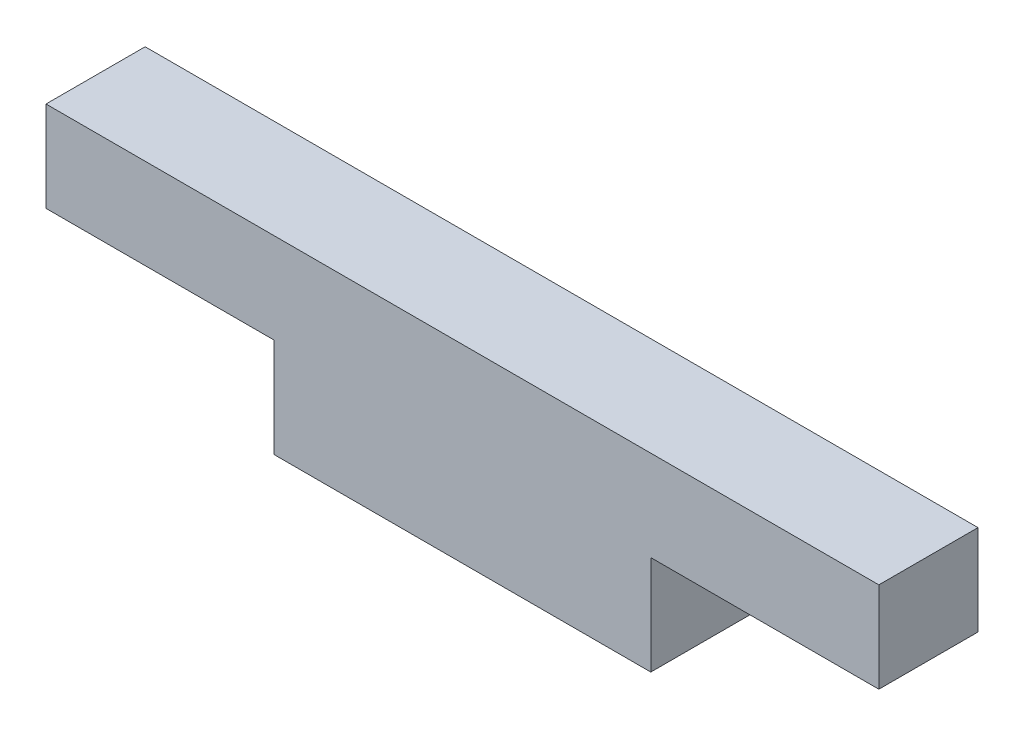
ISO-10303-21;
HEADER;
FILE_DESCRIPTION(('STEP AP214'),'2;1');
FILE_NAME('part.step','',(''),(''),'','','');
FILE_SCHEMA(('AUTOMOTIVE_DESIGN { 1 0 10303 214 1 1 1 1 }'));
ENDSEC;
DATA;
#1=APPLICATION_CONTEXT('core data for automotive mechanical design processes');
#2=APPLICATION_PROTOCOL_DEFINITION('international standard','automotive_design',2000,#1);
#3=PRODUCT_CONTEXT('',#1,'mechanical');
#4=PRODUCT('Part','Part','',(#3));
#5=PRODUCT_RELATED_PRODUCT_CATEGORY('part','',(#4));
#6=PRODUCT_DEFINITION_FORMATION('','',#4);
#7=PRODUCT_DEFINITION_CONTEXT('part definition',#1,'design');
#8=PRODUCT_DEFINITION('design','',#6,#7);
#9=PRODUCT_DEFINITION_SHAPE('','',#8);
#10=(LENGTH_UNIT() NAMED_UNIT(*) SI_UNIT(.MILLI.,.METRE.));
#11=(NAMED_UNIT(*) PLANE_ANGLE_UNIT() SI_UNIT($,.RADIAN.));
#12=(NAMED_UNIT(*) SI_UNIT($,.STERADIAN.) SOLID_ANGLE_UNIT());
#13=UNCERTAINTY_MEASURE_WITH_UNIT(LENGTH_MEASURE(1.E-05),#10,'distance_accuracy_value','');
#14=(GEOMETRIC_REPRESENTATION_CONTEXT(3) GLOBAL_UNCERTAINTY_ASSIGNED_CONTEXT((#13)) GLOBAL_UNIT_ASSIGNED_CONTEXT((#10,
#11,#12)) REPRESENTATION_CONTEXT('',''));
#15=CARTESIAN_POINT('',(0.,0.,0.));
#16=DIRECTION('',(0.,0.,1.));
#17=DIRECTION('',(1.,0.,0.));
#18=AXIS2_PLACEMENT_3D('',#15,#16,#17);
#19=CARTESIAN_POINT('',(0.,0.,0.));
#20=DIRECTION('',(0.,0.,1.));
#21=DIRECTION('',(1.,0.,0.));
#22=AXIS2_PLACEMENT_3D('',#19,#20,#21);
#23=PLANE('',#22);
#24=DIRECTION('',(1.,0.,0.));
#25=VECTOR('',#24,1.);
#26=CARTESIAN_POINT('',(21.,9.56,0.));
#27=LINE('',#26,#25);
#28=CARTESIAN_POINT('',(-21.,9.55999999999999,0.));
#29=VERTEX_POINT('',#28);
#30=CARTESIAN_POINT('',(21.,9.56,0.));
#31=VERTEX_POINT('',#30);
#32=EDGE_CURVE('E124',#29,#31,#27,.T.);
#33=ORIENTED_EDGE('',*,*,#32,.T.);
#34=DIRECTION('',(0.,-1.,0.));
#35=VECTOR('',#34,1.);
#36=CARTESIAN_POINT('',(21.,5.,0.));
#37=LINE('',#36,#35);
#38=CARTESIAN_POINT('',(21.,5.,0.));
#39=VERTEX_POINT('',#38);
#40=EDGE_CURVE('E119',#31,#39,#37,.T.);
#41=ORIENTED_EDGE('',*,*,#40,.T.);
#42=DIRECTION('',(-1.,0.,0.));
#43=VECTOR('',#42,1.);
#44=CARTESIAN_POINT('',(21.,5.,0.));
#45=LINE('',#44,#43);
#46=CARTESIAN_POINT('',(9.5,4.99999999999999,0.));
#47=VERTEX_POINT('',#46);
#48=EDGE_CURVE('E114',#39,#47,#45,.T.);
#49=ORIENTED_EDGE('',*,*,#48,.T.);
#50=DIRECTION('',(0.,-1.,0.));
#51=VECTOR('',#50,1.);
#52=CARTESIAN_POINT('',(9.5,4.99999999999999,0.));
#53=LINE('',#52,#51);
#54=CARTESIAN_POINT('',(9.5,0.,0.));
#55=VERTEX_POINT('',#54);
#56=EDGE_CURVE('E109',#47,#55,#53,.T.);
#57=ORIENTED_EDGE('',*,*,#56,.T.);
#58=DIRECTION('',(-1.,0.,0.));
#59=VECTOR('',#58,1.);
#60=CARTESIAN_POINT('',(9.5,0.,0.));
#61=LINE('',#60,#59);
#62=CARTESIAN_POINT('',(-9.5,0.,0.));
#63=VERTEX_POINT('',#62);
#64=EDGE_CURVE('E105',#55,#63,#61,.T.);
#65=ORIENTED_EDGE('',*,*,#64,.T.);
#66=DIRECTION('',(0.,1.,0.));
#67=VECTOR('',#66,1.);
#68=CARTESIAN_POINT('',(-9.5,4.99999999999999,0.));
#69=LINE('',#68,#67);
#70=CARTESIAN_POINT('',(-9.5,4.99999999999999,0.));
#71=VERTEX_POINT('',#70);
#72=EDGE_CURVE('E92',#63,#71,#69,.T.);
#73=ORIENTED_EDGE('',*,*,#72,.T.);
#74=DIRECTION('',(-1.,0.,0.));
#75=VECTOR('',#74,1.);
#76=CARTESIAN_POINT('',(-21.,4.99999999999999,0.));
#77=LINE('',#76,#75);
#78=CARTESIAN_POINT('',(-21.,4.99999999999999,0.));
#79=VERTEX_POINT('',#78);
#80=EDGE_CURVE('E78',#71,#79,#77,.T.);
#81=ORIENTED_EDGE('',*,*,#80,.T.);
#82=DIRECTION('',(0.,1.,0.));
#83=VECTOR('',#82,1.);
#84=CARTESIAN_POINT('',(-21.,4.99999999999999,0.));
#85=LINE('',#84,#83);
#86=EDGE_CURVE('E19',#79,#29,#85,.T.);
#87=ORIENTED_EDGE('',*,*,#86,.T.);
#88=EDGE_LOOP('',(#33,#41,#49,#57,#65,#73,#81,#87));
#89=FACE_BOUND('',#88,.T.);
#90=ADVANCED_FACE('F16',(#89),#23,.F.);
#91=CARTESIAN_POINT('',(-21.,4.99999999999999,5.));
#92=DIRECTION('',(1.,0.,0.));
#93=DIRECTION('',(0.,1.,0.));
#94=AXIS2_PLACEMENT_3D('',#91,#92,#93);
#95=PLANE('',#94);
#96=DIRECTION('',(0.,0.,1.));
#97=VECTOR('',#96,1.);
#98=CARTESIAN_POINT('',(-21.,4.99999999999999,5.));
#99=LINE('',#98,#97);
#100=CARTESIAN_POINT('',(-21.,4.99999999999999,5.));
#101=VERTEX_POINT('',#100);
#102=EDGE_CURVE('E84',#79,#101,#99,.T.);
#103=ORIENTED_EDGE('',*,*,#102,.T.);
#104=DIRECTION('',(0.,1.,0.));
#105=VECTOR('',#104,1.);
#106=CARTESIAN_POINT('',(-21.,0.,5.));
#107=LINE('',#106,#105);
#108=CARTESIAN_POINT('',(-21.,9.55999999999999,5.));
#109=VERTEX_POINT('',#108);
#110=EDGE_CURVE('E126',#109,#101,#107,.F.);
#111=ORIENTED_EDGE('',*,*,#110,.F.);
#112=DIRECTION('',(0.,0.,1.));
#113=VECTOR('',#112,1.);
#114=CARTESIAN_POINT('',(-21.,9.55999999999999,5.));
#115=LINE('',#114,#113);
#116=EDGE_CURVE('E87',#109,#29,#115,.F.);
#117=ORIENTED_EDGE('',*,*,#116,.T.);
#118=ORIENTED_EDGE('',*,*,#86,.F.);
#119=EDGE_LOOP('',(#103,#111,#117,#118));
#120=FACE_BOUND('',#119,.T.);
#121=ADVANCED_FACE('F83',(#120),#95,.F.);
#122=CARTESIAN_POINT('',(-21.,4.99999999999999,5.));
#123=DIRECTION('',(0.,1.,0.));
#124=DIRECTION('',(-1.,0.,0.));
#125=AXIS2_PLACEMENT_3D('',#122,#123,#124);
#126=PLANE('',#125);
#127=DIRECTION('',(0.,0.,-1.));
#128=VECTOR('',#127,1.);
#129=CARTESIAN_POINT('',(-9.5,4.99999999999999,5.));
#130=LINE('',#129,#128);
#131=CARTESIAN_POINT('',(-9.5,4.99999999999999,5.));
#132=VERTEX_POINT('',#131);
#133=EDGE_CURVE('E94',#71,#132,#130,.F.);
#134=ORIENTED_EDGE('',*,*,#133,.T.);
#135=DIRECTION('',(1.,0.,0.));
#136=VECTOR('',#135,1.);
#137=CARTESIAN_POINT('',(0.,4.99999999999999,5.));
#138=LINE('',#137,#136);
#139=EDGE_CURVE('E98',#101,#132,#138,.T.);
#140=ORIENTED_EDGE('',*,*,#139,.F.);
#141=ORIENTED_EDGE('',*,*,#102,.F.);
#142=ORIENTED_EDGE('',*,*,#80,.F.);
#143=EDGE_LOOP('',(#134,#140,#141,#142));
#144=FACE_BOUND('',#143,.T.);
#145=ADVANCED_FACE('F96',(#144),#126,.F.);
#146=CARTESIAN_POINT('',(-9.5,4.99999999999999,5.));
#147=DIRECTION('',(1.,0.,0.));
#148=DIRECTION('',(0.,0.,-1.));
#149=AXIS2_PLACEMENT_3D('',#146,#147,#148);
#150=PLANE('',#149);
#151=DIRECTION('',(0.,0.,1.));
#152=VECTOR('',#151,1.);
#153=CARTESIAN_POINT('',(-9.5,0.,5.));
#154=LINE('',#153,#152);
#155=CARTESIAN_POINT('',(-9.5,0.,5.));
#156=VERTEX_POINT('',#155);
#157=EDGE_CURVE('E103',#63,#156,#154,.T.);
#158=ORIENTED_EDGE('',*,*,#157,.T.);
#159=DIRECTION('',(0.,1.,0.));
#160=VECTOR('',#159,1.);
#161=CARTESIAN_POINT('',(-9.5,0.,5.));
#162=LINE('',#161,#160);
#163=EDGE_CURVE('E129',#132,#156,#162,.F.);
#164=ORIENTED_EDGE('',*,*,#163,.F.);
#165=ORIENTED_EDGE('',*,*,#133,.F.);
#166=ORIENTED_EDGE('',*,*,#72,.F.);
#167=EDGE_LOOP('',(#158,#164,#165,#166));
#168=FACE_BOUND('',#167,.T.);
#169=ADVANCED_FACE('F171',(#168),#150,.F.);
#170=CARTESIAN_POINT('',(9.5,0.,5.));
#171=DIRECTION('',(0.,1.,0.));
#172=DIRECTION('',(-1.,0.,0.));
#173=AXIS2_PLACEMENT_3D('',#170,#171,#172);
#174=PLANE('',#173);
#175=DIRECTION('',(0.,0.,1.));
#176=VECTOR('',#175,1.);
#177=CARTESIAN_POINT('',(9.5,0.,5.));
#178=LINE('',#177,#176);
#179=CARTESIAN_POINT('',(9.5,0.,5.));
#180=VERTEX_POINT('',#179);
#181=EDGE_CURVE('E107',#55,#180,#178,.T.);
#182=ORIENTED_EDGE('',*,*,#181,.T.);
#183=DIRECTION('',(1.,0.,0.));
#184=VECTOR('',#183,1.);
#185=CARTESIAN_POINT('',(0.,0.,5.));
#186=LINE('',#185,#184);
#187=EDGE_CURVE('E132',#156,#180,#186,.T.);
#188=ORIENTED_EDGE('',*,*,#187,.F.);
#189=ORIENTED_EDGE('',*,*,#157,.F.);
#190=ORIENTED_EDGE('',*,*,#64,.F.);
#191=EDGE_LOOP('',(#182,#188,#189,#190));
#192=FACE_BOUND('',#191,.T.);
#193=ADVANCED_FACE('F167',(#192),#174,.F.);
#194=CARTESIAN_POINT('',(9.5,4.99999999999999,5.));
#195=DIRECTION('',(-1.,0.,0.));
#196=DIRECTION('',(0.,-1.,0.));
#197=AXIS2_PLACEMENT_3D('',#194,#195,#196);
#198=PLANE('',#197);
#199=DIRECTION('',(0.,0.,1.));
#200=VECTOR('',#199,1.);
#201=CARTESIAN_POINT('',(9.5,4.99999999999999,5.));
#202=LINE('',#201,#200);
#203=CARTESIAN_POINT('',(9.5,4.99999999999999,5.));
#204=VERTEX_POINT('',#203);
#205=EDGE_CURVE('E112',#47,#204,#202,.T.);
#206=ORIENTED_EDGE('',*,*,#205,.T.);
#207=DIRECTION('',(0.,1.,0.));
#208=VECTOR('',#207,1.);
#209=CARTESIAN_POINT('',(9.5,0.,5.));
#210=LINE('',#209,#208);
#211=EDGE_CURVE('E135',#180,#204,#210,.T.);
#212=ORIENTED_EDGE('',*,*,#211,.F.);
#213=ORIENTED_EDGE('',*,*,#181,.F.);
#214=ORIENTED_EDGE('',*,*,#56,.F.);
#215=EDGE_LOOP('',(#206,#212,#213,#214));
#216=FACE_BOUND('',#215,.T.);
#217=ADVANCED_FACE('F164',(#216),#198,.F.);
#218=CARTESIAN_POINT('',(21.,5.,5.));
#219=DIRECTION('',(0.,1.,0.));
#220=DIRECTION('',(-1.,0.,0.));
#221=AXIS2_PLACEMENT_3D('',#218,#219,#220);
#222=PLANE('',#221);
#223=DIRECTION('',(0.,0.,1.));
#224=VECTOR('',#223,1.);
#225=CARTESIAN_POINT('',(21.,5.,5.));
#226=LINE('',#225,#224);
#227=CARTESIAN_POINT('',(21.,5.,5.));
#228=VERTEX_POINT('',#227);
#229=EDGE_CURVE('E117',#39,#228,#226,.T.);
#230=ORIENTED_EDGE('',*,*,#229,.T.);
#231=DIRECTION('',(1.,0.,0.));
#232=VECTOR('',#231,1.);
#233=CARTESIAN_POINT('',(0.,4.99999999999999,5.));
#234=LINE('',#233,#232);
#235=EDGE_CURVE('E138',#204,#228,#234,.T.);
#236=ORIENTED_EDGE('',*,*,#235,.F.);
#237=ORIENTED_EDGE('',*,*,#205,.F.);
#238=ORIENTED_EDGE('',*,*,#48,.F.);
#239=EDGE_LOOP('',(#230,#236,#237,#238));
#240=FACE_BOUND('',#239,.T.);
#241=ADVANCED_FACE('F148',(#240),#222,.F.);
#242=CARTESIAN_POINT('',(21.,5.,5.));
#243=DIRECTION('',(-1.,0.,0.));
#244=DIRECTION('',(0.,-1.,0.));
#245=AXIS2_PLACEMENT_3D('',#242,#243,#244);
#246=PLANE('',#245);
#247=DIRECTION('',(0.,0.,1.));
#248=VECTOR('',#247,1.);
#249=CARTESIAN_POINT('',(21.,9.56,5.));
#250=LINE('',#249,#248);
#251=CARTESIAN_POINT('',(21.,9.56,5.));
#252=VERTEX_POINT('',#251);
#253=EDGE_CURVE('E34',#31,#252,#250,.T.);
#254=ORIENTED_EDGE('',*,*,#253,.T.);
#255=DIRECTION('',(0.,1.,0.));
#256=VECTOR('',#255,1.);
#257=CARTESIAN_POINT('',(21.,0.,5.));
#258=LINE('',#257,#256);
#259=EDGE_CURVE('E25',#228,#252,#258,.T.);
#260=ORIENTED_EDGE('',*,*,#259,.F.);
#261=ORIENTED_EDGE('',*,*,#229,.F.);
#262=ORIENTED_EDGE('',*,*,#40,.F.);
#263=EDGE_LOOP('',(#254,#260,#261,#262));
#264=FACE_BOUND('',#263,.T.);
#265=ADVANCED_FACE('F146',(#264),#246,.F.);
#266=CARTESIAN_POINT('',(21.,9.56,5.));
#267=DIRECTION('',(0.,-1.,0.));
#268=DIRECTION('',(1.,0.,0.));
#269=AXIS2_PLACEMENT_3D('',#266,#267,#268);
#270=PLANE('',#269);
#271=ORIENTED_EDGE('',*,*,#116,.F.);
#272=DIRECTION('',(1.,0.,0.));
#273=VECTOR('',#272,1.);
#274=CARTESIAN_POINT('',(0.,9.56,5.));
#275=LINE('',#274,#273);
#276=EDGE_CURVE('E11',#252,#109,#275,.F.);
#277=ORIENTED_EDGE('',*,*,#276,.F.);
#278=ORIENTED_EDGE('',*,*,#253,.F.);
#279=ORIENTED_EDGE('',*,*,#32,.F.);
#280=EDGE_LOOP('',(#271,#277,#278,#279));
#281=FACE_BOUND('',#280,.T.);
#282=ADVANCED_FACE('F151',(#281),#270,.F.);
#283=CARTESIAN_POINT('',(0.,0.,5.));
#284=DIRECTION('',(0.,0.,1.));
#285=DIRECTION('',(1.,0.,0.));
#286=AXIS2_PLACEMENT_3D('',#283,#284,#285);
#287=PLANE('',#286);
#288=ORIENTED_EDGE('',*,*,#259,.T.);
#289=ORIENTED_EDGE('',*,*,#276,.T.);
#290=ORIENTED_EDGE('',*,*,#110,.T.);
#291=ORIENTED_EDGE('',*,*,#139,.T.);
#292=ORIENTED_EDGE('',*,*,#163,.T.);
#293=ORIENTED_EDGE('',*,*,#187,.T.);
#294=ORIENTED_EDGE('',*,*,#211,.T.);
#295=ORIENTED_EDGE('',*,*,#235,.T.);
#296=EDGE_LOOP('',(#288,#289,#290,#291,#292,#293,#294,#295));
#297=FACE_BOUND('',#296,.T.);
#298=ADVANCED_FACE('F143',(#297),#287,.T.);
#299=CLOSED_SHELL('',(#90,#121,#145,#169,#193,#217,#241,#265,#282,#298));
#300=MANIFOLD_SOLID_BREP('B1',#299);
#301=ADVANCED_BREP_SHAPE_REPRESENTATION('',(#18,#300),#14);
#302=SHAPE_DEFINITION_REPRESENTATION(#9,#301);
ENDSEC;
END-ISO-10303-21;
